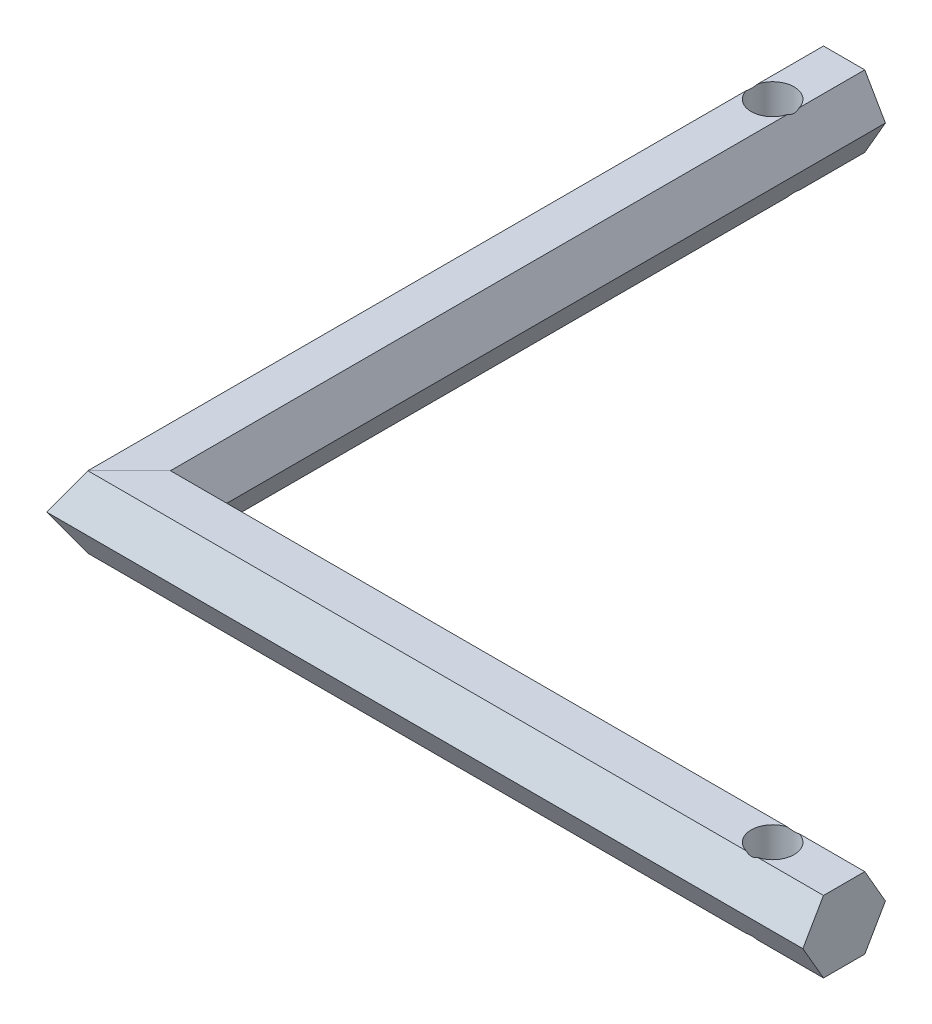
ISO-10303-21;
HEADER;
FILE_DESCRIPTION(('STEP AP214'),'2;1');
FILE_NAME('part.step','',(''),(''),'','','');
FILE_SCHEMA(('AUTOMOTIVE_DESIGN { 1 0 10303 214 1 1 1 1 }'));
ENDSEC;
DATA;
#1=APPLICATION_CONTEXT('core data for automotive mechanical design processes');
#2=APPLICATION_PROTOCOL_DEFINITION('international standard','automotive_design',2000,#1);
#3=PRODUCT_CONTEXT('',#1,'mechanical');
#4=PRODUCT('Part','Part','',(#3));
#5=PRODUCT_RELATED_PRODUCT_CATEGORY('part','',(#4));
#6=PRODUCT_DEFINITION_FORMATION('','',#4);
#7=PRODUCT_DEFINITION_CONTEXT('part definition',#1,'design');
#8=PRODUCT_DEFINITION('design','',#6,#7);
#9=PRODUCT_DEFINITION_SHAPE('','',#8);
#10=(LENGTH_UNIT() NAMED_UNIT(*) SI_UNIT(.MILLI.,.METRE.));
#11=(NAMED_UNIT(*) PLANE_ANGLE_UNIT() SI_UNIT($,.RADIAN.));
#12=(NAMED_UNIT(*) SI_UNIT($,.STERADIAN.) SOLID_ANGLE_UNIT());
#13=UNCERTAINTY_MEASURE_WITH_UNIT(LENGTH_MEASURE(1.E-05),#10,'distance_accuracy_value','');
#14=(GEOMETRIC_REPRESENTATION_CONTEXT(3) GLOBAL_UNCERTAINTY_ASSIGNED_CONTEXT((#13)) GLOBAL_UNIT_ASSIGNED_CONTEXT((#10,
#11,#12)) REPRESENTATION_CONTEXT('',''));
#15=CARTESIAN_POINT('',(0.,0.,0.));
#16=DIRECTION('',(0.,0.,1.));
#17=DIRECTION('',(1.,0.,0.));
#18=AXIS2_PLACEMENT_3D('',#15,#16,#17);
#19=CARTESIAN_POINT('',(-6.45085296108587,4.99999999999999,-2.88675134594811));
#20=DIRECTION('',(0.,1.,0.));
#21=DIRECTION('',(0.,0.,1.));
#22=AXIS2_PLACEMENT_3D('',#19,#20,#21);
#23=PLANE('',#22);
#24=CARTESIAN_POINT('',(90.,4.99999999999999,0.));
#25=DIRECTION('',(0.,1.,0.));
#26=DIRECTION('',(0.,0.,1.));
#27=AXIS2_PLACEMENT_3D('',#24,#25,#26);
#28=CIRCLE('',#27,3.00000000000001);
#29=CARTESIAN_POINT('',(90.8164965809278,4.99999999999999,2.88675134594813));
#30=VERTEX_POINT('',#29);
#31=CARTESIAN_POINT('',(90.8164965809278,4.99999999999999,-2.88675134594811));
#32=VERTEX_POINT('',#31);
#33=EDGE_CURVE('E360',#30,#32,#28,.T.);
#34=ORIENTED_EDGE('',*,*,#33,.F.);
#35=DIRECTION('',(1.,0.,0.));
#36=VECTOR('',#35,1.);
#37=CARTESIAN_POINT('',(-6.45085296108587,4.99999999999997,2.88675134594814));
#38=LINE('',#37,#36);
#39=CARTESIAN_POINT('',(100.,4.99999999999997,2.88675134594814));
#40=VERTEX_POINT('',#39);
#41=EDGE_CURVE('E266',#30,#40,#38,.T.);
#42=ORIENTED_EDGE('',*,*,#41,.T.);
#43=DIRECTION('',(0.,0.,1.));
#44=VECTOR('',#43,1.);
#45=CARTESIAN_POINT('',(100.,4.99999999999999,-2.88675134594811));
#46=LINE('',#45,#44);
#47=CARTESIAN_POINT('',(100.,4.99999999999999,-2.88675134594811));
#48=VERTEX_POINT('',#47);
#49=EDGE_CURVE('E246',#48,#40,#46,.T.);
#50=ORIENTED_EDGE('',*,*,#49,.F.);
#51=DIRECTION('',(1.,0.,0.));
#52=VECTOR('',#51,1.);
#53=CARTESIAN_POINT('',(-6.45085296108587,4.99999999999999,-2.88675134594811));
#54=LINE('',#53,#52);
#55=EDGE_CURVE('E271',#32,#48,#54,.T.);
#56=ORIENTED_EDGE('',*,*,#55,.F.);
#57=EDGE_LOOP('',(#34,#42,#50,#56));
#58=FACE_BOUND('',#57,.T.);
#59=ADVANCED_FACE('F39',(#58),#23,.T.);
#60=CARTESIAN_POINT('',(-6.45085296108587,-5.00000000000001,2.88675134594807));
#61=DIRECTION('',(0.,-1.,0.));
#62=DIRECTION('',(0.,0.,-1.));
#63=AXIS2_PLACEMENT_3D('',#60,#61,#62);
#64=PLANE('',#63);
#65=CARTESIAN_POINT('',(90.,-5.00000000000001,0.));
#66=DIRECTION('',(0.,1.,0.));
#67=DIRECTION('',(0.,0.,1.));
#68=AXIS2_PLACEMENT_3D('',#65,#66,#67);
#69=CIRCLE('',#68,3.00000000000001);
#70=CARTESIAN_POINT('',(90.816496580928,-5.00000000000001,2.88675134594807));
#71=VERTEX_POINT('',#70);
#72=CARTESIAN_POINT('',(90.8164965809276,-5.00000000000001,-2.88675134594818));
#73=VERTEX_POINT('',#72);
#74=EDGE_CURVE('E295',#71,#73,#69,.T.);
#75=ORIENTED_EDGE('',*,*,#74,.T.);
#76=DIRECTION('',(1.,0.,0.));
#77=VECTOR('',#76,1.);
#78=CARTESIAN_POINT('',(-6.45085296108587,-4.99999999999995,-2.88675134594818));
#79=LINE('',#78,#77);
#80=CARTESIAN_POINT('',(100.,-4.99999999999995,-2.88675134594818));
#81=VERTEX_POINT('',#80);
#82=EDGE_CURVE('E280',#73,#81,#79,.T.);
#83=ORIENTED_EDGE('',*,*,#82,.T.);
#84=DIRECTION('',(0.,0.,-1.));
#85=VECTOR('',#84,1.);
#86=CARTESIAN_POINT('',(100.,-5.00000000000001,2.88675134594807));
#87=LINE('',#86,#85);
#88=CARTESIAN_POINT('',(100.,-5.00000000000001,2.88675134594807));
#89=VERTEX_POINT('',#88);
#90=EDGE_CURVE('E234',#89,#81,#87,.T.);
#91=ORIENTED_EDGE('',*,*,#90,.F.);
#92=DIRECTION('',(1.,0.,0.));
#93=VECTOR('',#92,1.);
#94=CARTESIAN_POINT('',(-6.45085296108587,-5.00000000000001,2.88675134594807));
#95=LINE('',#94,#93);
#96=EDGE_CURVE('E257',#71,#89,#95,.T.);
#97=ORIENTED_EDGE('',*,*,#96,.F.);
#98=EDGE_LOOP('',(#75,#83,#91,#97));
#99=FACE_BOUND('',#98,.T.);
#100=ADVANCED_FACE('F293',(#99),#64,.T.);
#101=CARTESIAN_POINT('',(-2.88675134594807,-5.00000000000001,-100.));
#102=DIRECTION('',(0.,-1.,0.));
#103=DIRECTION('',(1.,0.,0.));
#104=AXIS2_PLACEMENT_3D('',#101,#102,#103);
#105=PLANE('',#104);
#106=CARTESIAN_POINT('',(0.,-5.00000000000001,-90.));
#107=DIRECTION('',(0.,1.,0.));
#108=DIRECTION('',(0.,0.,1.));
#109=AXIS2_PLACEMENT_3D('',#106,#107,#108);
#110=CIRCLE('',#109,3.);
#111=CARTESIAN_POINT('',(-2.88675134594807,-5.00000000000001,-89.1835034190721));
#112=VERTEX_POINT('',#111);
#113=CARTESIAN_POINT('',(2.88675134594814,-5.00000000000001,-89.1835034190723));
#114=VERTEX_POINT('',#113);
#115=EDGE_CURVE('E160',#112,#114,#110,.T.);
#116=ORIENTED_EDGE('',*,*,#115,.T.);
#117=DIRECTION('',(0.,0.,1.));
#118=VECTOR('',#117,1.);
#119=CARTESIAN_POINT('',(2.88675134594818,-4.99999999999995,-100.));
#120=LINE('',#119,#118);
#121=CARTESIAN_POINT('',(2.88675134594818,-4.99999999999995,-2.88675134594818));
#122=VERTEX_POINT('',#121);
#123=EDGE_CURVE('E174',#114,#122,#120,.T.);
#124=ORIENTED_EDGE('',*,*,#123,.T.);
#125=DIRECTION('',(-0.707106781186548,0.,0.707106781186548));
#126=VECTOR('',#125,1.);
#127=CARTESIAN_POINT('',(48.556624327026,-4.99999999999948,-48.556624327026));
#128=LINE('',#127,#126);
#129=CARTESIAN_POINT('',(-2.88675134594807,-5.00000000000001,2.88675134594808));
#130=VERTEX_POINT('',#129);
#131=EDGE_CURVE('E233',#122,#130,#128,.T.);
#132=ORIENTED_EDGE('',*,*,#131,.T.);
#133=DIRECTION('',(0.,0.,1.));
#134=VECTOR('',#133,1.);
#135=CARTESIAN_POINT('',(-2.88675134594807,-5.00000000000001,-100.));
#136=LINE('',#135,#134);
#137=EDGE_CURVE('E176',#112,#130,#136,.T.);
#138=ORIENTED_EDGE('',*,*,#137,.F.);
#139=EDGE_LOOP('',(#116,#124,#132,#138));
#140=FACE_BOUND('',#139,.T.);
#141=ADVANCED_FACE('F172',(#140),#105,.T.);
#142=CARTESIAN_POINT('',(2.88675134594811,4.99999999999999,-100.));
#143=DIRECTION('',(0.,1.,0.));
#144=DIRECTION('',(-1.,0.,0.));
#145=AXIS2_PLACEMENT_3D('',#142,#143,#144);
#146=PLANE('',#145);
#147=CARTESIAN_POINT('',(0.,4.99999999999999,-90.));
#148=DIRECTION('',(0.,1.,0.));
#149=DIRECTION('',(0.,0.,1.));
#150=AXIS2_PLACEMENT_3D('',#147,#148,#149);
#151=CIRCLE('',#150,3.);
#152=CARTESIAN_POINT('',(-2.88675134594814,4.99999999999999,-89.1835034190723));
#153=VERTEX_POINT('',#152);
#154=CARTESIAN_POINT('',(2.88675134594811,4.99999999999999,-89.1835034190722));
#155=VERTEX_POINT('',#154);
#156=EDGE_CURVE('E359',#153,#155,#151,.T.);
#157=ORIENTED_EDGE('',*,*,#156,.F.);
#158=DIRECTION('',(0.,0.,1.));
#159=VECTOR('',#158,1.);
#160=CARTESIAN_POINT('',(-2.88675134594814,4.99999999999997,-100.));
#161=LINE('',#160,#159);
#162=CARTESIAN_POINT('',(-2.88675134594814,4.99999999999997,2.88675134594813));
#163=VERTEX_POINT('',#162);
#164=EDGE_CURVE('E207',#153,#163,#161,.T.);
#165=ORIENTED_EDGE('',*,*,#164,.T.);
#166=DIRECTION('',(0.707106781186548,0.,-0.707106781186548));
#167=VECTOR('',#166,1.);
#168=CARTESIAN_POINT('',(51.4433756729741,5.00000000000017,-51.4433756729741));
#169=LINE('',#168,#167);
#170=CARTESIAN_POINT('',(2.88675134594811,4.99999999999999,-2.8867513459481));
#171=VERTEX_POINT('',#170);
#172=EDGE_CURVE('E316',#163,#171,#169,.T.);
#173=ORIENTED_EDGE('',*,*,#172,.T.);
#174=DIRECTION('',(0.,0.,1.));
#175=VECTOR('',#174,1.);
#176=CARTESIAN_POINT('',(2.88675134594811,4.99999999999999,-100.));
#177=LINE('',#176,#175);
#178=EDGE_CURVE('E208',#155,#171,#177,.T.);
#179=ORIENTED_EDGE('',*,*,#178,.F.);
#180=EDGE_LOOP('',(#157,#165,#173,#179));
#181=FACE_BOUND('',#180,.T.);
#182=ADVANCED_FACE('F377',(#181),#146,.T.);
#183=CARTESIAN_POINT('',(100.,0.,0.));
#184=DIRECTION('',(1.,0.,0.));
#185=DIRECTION('',(0.,0.,-1.));
#186=AXIS2_PLACEMENT_3D('',#183,#184,#185);
#187=PLANE('',#186);
#188=DIRECTION('',(0.,0.866025403784441,-0.499999999999995));
#189=VECTOR('',#188,1.);
#190=CARTESIAN_POINT('',(100.,-4.99999999999995,-2.88675134594818));
#191=LINE('',#190,#189);
#192=CARTESIAN_POINT('',(100.,0.,-5.77350269189624));
#193=VERTEX_POINT('',#192);
#194=EDGE_CURVE('E254',#81,#193,#191,.T.);
#195=ORIENTED_EDGE('',*,*,#194,.T.);
#196=DIRECTION('',(0.,0.866025403784438,0.500000000000001));
#197=VECTOR('',#196,1.);
#198=CARTESIAN_POINT('',(100.,0.,-5.77350269189624));
#199=LINE('',#198,#197);
#200=EDGE_CURVE('E250',#193,#48,#199,.T.);
#201=ORIENTED_EDGE('',*,*,#200,.T.);
#202=ORIENTED_EDGE('',*,*,#49,.T.);
#203=DIRECTION('',(0.,-0.866025403784442,0.499999999999995));
#204=VECTOR('',#203,1.);
#205=CARTESIAN_POINT('',(100.,4.99999999999997,2.88675134594814));
#206=LINE('',#205,#204);
#207=CARTESIAN_POINT('',(100.,0.,5.77350269189624));
#208=VERTEX_POINT('',#207);
#209=EDGE_CURVE('E243',#40,#208,#206,.T.);
#210=ORIENTED_EDGE('',*,*,#209,.T.);
#211=DIRECTION('',(0.,-0.866025403784434,-0.500000000000007));
#212=VECTOR('',#211,1.);
#213=CARTESIAN_POINT('',(100.,0.,5.77350269189624));
#214=LINE('',#213,#212);
#215=EDGE_CURVE('E238',#208,#89,#214,.T.);
#216=ORIENTED_EDGE('',*,*,#215,.T.);
#217=ORIENTED_EDGE('',*,*,#90,.T.);
#218=EDGE_LOOP('',(#195,#201,#202,#210,#216,#217));
#219=FACE_BOUND('',#218,.T.);
#220=ADVANCED_FACE('F41',(#219),#187,.T.);
#221=CARTESIAN_POINT('',(0.,0.,-100.));
#222=DIRECTION('',(0.,0.,1.));
#223=DIRECTION('',(1.,0.,0.));
#224=AXIS2_PLACEMENT_3D('',#221,#222,#223);
#225=PLANE('',#224);
#226=DIRECTION('',(0.499999999999995,0.866025403784441,0.));
#227=VECTOR('',#226,1.);
#228=CARTESIAN_POINT('',(2.88675134594818,-4.99999999999995,-100.));
#229=LINE('',#228,#227);
#230=CARTESIAN_POINT('',(2.88675134594818,-4.99999999999995,-100.));
#231=VERTEX_POINT('',#230);
#232=CARTESIAN_POINT('',(5.77350269189624,0.,-100.));
#233=VERTEX_POINT('',#232);
#234=EDGE_CURVE('E202',#231,#233,#229,.T.);
#235=ORIENTED_EDGE('',*,*,#234,.F.);
#236=DIRECTION('',(1.,0.,0.));
#237=VECTOR('',#236,1.);
#238=CARTESIAN_POINT('',(-2.88675134594807,-5.00000000000001,-100.));
#239=LINE('',#238,#237);
#240=CARTESIAN_POINT('',(-2.88675134594807,-5.00000000000001,-100.));
#241=VERTEX_POINT('',#240);
#242=EDGE_CURVE('E186',#241,#231,#239,.T.);
#243=ORIENTED_EDGE('',*,*,#242,.F.);
#244=DIRECTION('',(0.500000000000007,-0.866025403784434,0.));
#245=VECTOR('',#244,1.);
#246=CARTESIAN_POINT('',(-5.77350269189624,0.,-100.));
#247=LINE('',#246,#245);
#248=CARTESIAN_POINT('',(-5.77350269189624,0.,-100.));
#249=VERTEX_POINT('',#248);
#250=EDGE_CURVE('E192',#249,#241,#247,.T.);
#251=ORIENTED_EDGE('',*,*,#250,.F.);
#252=DIRECTION('',(-0.499999999999995,-0.866025403784442,0.));
#253=VECTOR('',#252,1.);
#254=CARTESIAN_POINT('',(-2.88675134594814,4.99999999999997,-100.));
#255=LINE('',#254,#253);
#256=CARTESIAN_POINT('',(-2.88675134594814,4.99999999999997,-100.));
#257=VERTEX_POINT('',#256);
#258=EDGE_CURVE('E212',#257,#249,#255,.T.);
#259=ORIENTED_EDGE('',*,*,#258,.F.);
#260=DIRECTION('',(-1.,0.,0.));
#261=VECTOR('',#260,1.);
#262=CARTESIAN_POINT('',(2.88675134594811,4.99999999999999,-100.));
#263=LINE('',#262,#261);
#264=CARTESIAN_POINT('',(2.88675134594811,4.99999999999999,-100.));
#265=VERTEX_POINT('',#264);
#266=EDGE_CURVE('E201',#265,#257,#263,.T.);
#267=ORIENTED_EDGE('',*,*,#266,.F.);
#268=DIRECTION('',(-0.500000000000001,0.866025403784438,0.));
#269=VECTOR('',#268,1.);
#270=CARTESIAN_POINT('',(5.77350269189624,0.,-100.));
#271=LINE('',#270,#269);
#272=EDGE_CURVE('E197',#233,#265,#271,.T.);
#273=ORIENTED_EDGE('',*,*,#272,.F.);
#274=EDGE_LOOP('',(#235,#243,#251,#259,#267,#273));
#275=FACE_BOUND('',#274,.T.);
#276=ADVANCED_FACE('F376',(#275),#225,.F.);
#277=CARTESIAN_POINT('',(-6.45085296108587,-4.99999999999995,-2.88675134594818));
#278=DIRECTION('',(0.,-0.499999999999995,-0.866025403784442));
#279=DIRECTION('',(0.,0.866025403784442,-0.499999999999995));
#280=AXIS2_PLACEMENT_3D('',#277,#278,#279);
#281=PLANE('',#280);
#282=CARTESIAN_POINT('',(90.,-10.0000000000001,0.));
#283=DIRECTION('',(0.,-0.499999999999995,-0.866025403784442));
#284=DIRECTION('',(0.,0.866025403784442,-0.499999999999995));
#285=AXIS2_PLACEMENT_3D('',#282,#283,#284);
#286=ELLIPSE('',#285,6.00000000000008,3.00000000000001);
#287=CARTESIAN_POINT('',(89.1835034190724,-5.00000000000001,-2.88675134594818));
#288=VERTEX_POINT('',#287);
#289=EDGE_CURVE('E239',#288,#73,#286,.T.);
#290=ORIENTED_EDGE('',*,*,#289,.F.);
#291=EDGE_CURVE('E281',#122,#288,#79,.T.);
#292=ORIENTED_EDGE('',*,*,#291,.F.);
#293=DIRECTION('',(-0.447213595499954,-0.774596669241488,0.447213595499954));
#294=VECTOR('',#293,1.);
#295=CARTESIAN_POINT('',(22.3094010767582,28.6410161513775,-22.3094010767582));
#296=LINE('',#295,#294);
#297=CARTESIAN_POINT('',(5.77350269189624,0.,-5.77350269189624));
#298=VERTEX_POINT('',#297);
#299=EDGE_CURVE('E183',#298,#122,#296,.T.);
#300=ORIENTED_EDGE('',*,*,#299,.F.);
#301=DIRECTION('',(1.,0.,0.));
#302=VECTOR('',#301,1.);
#303=CARTESIAN_POINT('',(-6.45085296108587,0.,-5.77350269189624));
#304=LINE('',#303,#302);
#305=EDGE_CURVE('E276',#298,#193,#304,.T.);
#306=ORIENTED_EDGE('',*,*,#305,.T.);
#307=ORIENTED_EDGE('',*,*,#194,.F.);
#308=ORIENTED_EDGE('',*,*,#82,.F.);
#309=EDGE_LOOP('',(#290,#292,#300,#306,#307,#308));
#310=FACE_BOUND('',#309,.T.);
#311=ADVANCED_FACE('F302',(#310),#281,.T.);
#312=CARTESIAN_POINT('',(-6.45085296108587,0.,-5.77350269189624));
#313=DIRECTION('',(0.,0.500000000000001,-0.866025403784438));
#314=DIRECTION('',(0.,0.866025403784438,0.500000000000001));
#315=AXIS2_PLACEMENT_3D('',#312,#313,#314);
#316=PLANE('',#315);
#317=CARTESIAN_POINT('',(90.,9.99999999999994,0.));
#318=DIRECTION('',(0.,0.500000000000001,-0.866025403784438));
#319=DIRECTION('',(0.,0.866025403784438,0.500000000000001));
#320=AXIS2_PLACEMENT_3D('',#317,#318,#319);
#321=ELLIPSE('',#320,6.,3.00000000000001);
#322=CARTESIAN_POINT('',(89.1835034190722,4.99999999999999,-2.88675134594811));
#323=VERTEX_POINT('',#322);
#324=EDGE_CURVE('E340',#32,#323,#321,.T.);
#325=ORIENTED_EDGE('',*,*,#324,.F.);
#326=ORIENTED_EDGE('',*,*,#55,.T.);
#327=ORIENTED_EDGE('',*,*,#200,.F.);
#328=ORIENTED_EDGE('',*,*,#305,.F.);
#329=DIRECTION('',(0.447213595499959,-0.774596669241483,-0.447213595499959));
#330=VECTOR('',#329,1.);
#331=CARTESIAN_POINT('',(24.6188021535171,-32.6410161513776,-24.6188021535171));
#332=LINE('',#331,#330);
#333=EDGE_CURVE('E169',#171,#298,#332,.T.);
#334=ORIENTED_EDGE('',*,*,#333,.F.);
#335=EDGE_CURVE('E272',#171,#323,#54,.T.);
#336=ORIENTED_EDGE('',*,*,#335,.T.);
#337=EDGE_LOOP('',(#325,#326,#327,#328,#334,#336));
#338=FACE_BOUND('',#337,.T.);
#339=ADVANCED_FACE('F308',(#338),#316,.T.);
#340=CARTESIAN_POINT('',(89.1835034190723,4.99999999999997,2.88675134594814));
#341=VERTEX_POINT('',#340);
#342=EDGE_CURVE('E55',#323,#341,#28,.T.);
#343=ORIENTED_EDGE('',*,*,#342,.F.);
#344=ORIENTED_EDGE('',*,*,#335,.F.);
#345=ORIENTED_EDGE('',*,*,#172,.F.);
#346=EDGE_CURVE('E267',#163,#341,#38,.T.);
#347=ORIENTED_EDGE('',*,*,#346,.T.);
#348=EDGE_LOOP('',(#343,#344,#345,#347));
#349=FACE_BOUND('',#348,.T.);
#350=ADVANCED_FACE('F380',(#349),#23,.T.);
#351=CARTESIAN_POINT('',(-6.45085296108587,4.99999999999997,2.88675134594814));
#352=DIRECTION('',(0.,0.499999999999995,0.866025403784441));
#353=DIRECTION('',(0.,-0.866025403784441,0.499999999999995));
#354=AXIS2_PLACEMENT_3D('',#351,#352,#353);
#355=PLANE('',#354);
#356=CARTESIAN_POINT('',(90.,10.0000000000001,0.));
#357=DIRECTION('',(0.,0.499999999999995,0.866025403784441));
#358=DIRECTION('',(0.,0.866025403784441,-0.499999999999995));
#359=AXIS2_PLACEMENT_3D('',#356,#357,#358);
#360=ELLIPSE('',#359,6.00000000000007,3.00000000000001);
#361=EDGE_CURVE('E343',#341,#30,#360,.T.);
#362=ORIENTED_EDGE('',*,*,#361,.F.);
#363=ORIENTED_EDGE('',*,*,#346,.F.);
#364=DIRECTION('',(0.447213595499954,0.774596669241488,-0.447213595499954));
#365=VECTOR('',#364,1.);
#366=CARTESIAN_POINT('',(17.6905989232412,40.6410161513774,-17.6905989232412));
#367=LINE('',#366,#365);
#368=CARTESIAN_POINT('',(-5.77350269189624,0.,5.77350269189623));
#369=VERTEX_POINT('',#368);
#370=EDGE_CURVE('E328',#369,#163,#367,.T.);
#371=ORIENTED_EDGE('',*,*,#370,.F.);
#372=DIRECTION('',(1.,0.,0.));
#373=VECTOR('',#372,1.);
#374=CARTESIAN_POINT('',(-6.45085296108587,0.,5.77350269189624));
#375=LINE('',#374,#373);
#376=EDGE_CURVE('E262',#369,#208,#375,.T.);
#377=ORIENTED_EDGE('',*,*,#376,.T.);
#378=ORIENTED_EDGE('',*,*,#209,.F.);
#379=ORIENTED_EDGE('',*,*,#41,.F.);
#380=EDGE_LOOP('',(#362,#363,#371,#377,#378,#379));
#381=FACE_BOUND('',#380,.T.);
#382=ADVANCED_FACE('F382',(#381),#355,.T.);
#383=CARTESIAN_POINT('',(-6.45085296108587,0.,5.77350269189624));
#384=DIRECTION('',(0.,-0.500000000000007,0.866025403784435));
#385=DIRECTION('',(0.,-0.866025403784435,-0.500000000000007));
#386=AXIS2_PLACEMENT_3D('',#383,#384,#385);
#387=PLANE('',#386);
#388=CARTESIAN_POINT('',(90.,-9.99999999999982,0.));
#389=DIRECTION('',(0.,-0.500000000000007,0.866025403784435));
#390=DIRECTION('',(0.,0.866025403784435,0.500000000000007));
#391=AXIS2_PLACEMENT_3D('',#388,#389,#390);
#392=ELLIPSE('',#391,5.99999999999993,3.00000000000001);
#393=CARTESIAN_POINT('',(89.1835034190721,-5.00000000000001,2.88675134594807));
#394=VERTEX_POINT('',#393);
#395=EDGE_CURVE('E62',#71,#394,#392,.T.);
#396=ORIENTED_EDGE('',*,*,#395,.F.);
#397=ORIENTED_EDGE('',*,*,#96,.T.);
#398=ORIENTED_EDGE('',*,*,#215,.F.);
#399=ORIENTED_EDGE('',*,*,#376,.F.);
#400=DIRECTION('',(-0.447213595499963,0.774596669241478,0.447213595499963));
#401=VECTOR('',#400,1.);
#402=CARTESIAN_POINT('',(15.3811978464835,-36.6410161513777,-15.3811978464835));
#403=LINE('',#402,#401);
#404=EDGE_CURVE('E324',#130,#369,#403,.T.);
#405=ORIENTED_EDGE('',*,*,#404,.F.);
#406=EDGE_CURVE('E258',#130,#394,#95,.T.);
#407=ORIENTED_EDGE('',*,*,#406,.T.);
#408=EDGE_LOOP('',(#396,#397,#398,#399,#405,#407));
#409=FACE_BOUND('',#408,.T.);
#410=ADVANCED_FACE('F392',(#409),#387,.T.);
#411=CARTESIAN_POINT('',(90.,-4.99999999999998,0.));
#412=DIRECTION('',(0.,-1.,0.));
#413=DIRECTION('',(0.,0.,-1.));
#414=AXIS2_PLACEMENT_3D('',#411,#412,#413);
#415=CIRCLE('',#414,3.00000000000001);
#416=EDGE_CURVE('E11',#394,#288,#415,.T.);
#417=ORIENTED_EDGE('',*,*,#416,.F.);
#418=ORIENTED_EDGE('',*,*,#406,.F.);
#419=ORIENTED_EDGE('',*,*,#131,.F.);
#420=ORIENTED_EDGE('',*,*,#291,.T.);
#421=EDGE_LOOP('',(#417,#418,#419,#420));
#422=FACE_BOUND('',#421,.T.);
#423=ADVANCED_FACE('F393',(#422),#64,.T.);
#424=CARTESIAN_POINT('',(2.88675134594818,-4.99999999999995,-90.8164965809277));
#425=VERTEX_POINT('',#424);
#426=CARTESIAN_POINT('',(-2.88675134594807,-5.00000000000001,-90.8164965809279));
#427=VERTEX_POINT('',#426);
#428=EDGE_CURVE('E163',#425,#427,#110,.T.);
#429=ORIENTED_EDGE('',*,*,#428,.T.);
#430=EDGE_CURVE('E227',#241,#427,#136,.T.);
#431=ORIENTED_EDGE('',*,*,#430,.F.);
#432=ORIENTED_EDGE('',*,*,#242,.T.);
#433=EDGE_CURVE('E185',#231,#425,#120,.T.);
#434=ORIENTED_EDGE('',*,*,#433,.T.);
#435=EDGE_LOOP('',(#429,#431,#432,#434));
#436=FACE_BOUND('',#435,.T.);
#437=ADVANCED_FACE('F398',(#436),#105,.T.);
#438=CARTESIAN_POINT('',(-5.77350269189624,0.,-100.));
#439=DIRECTION('',(-0.866025403784434,-0.500000000000007,0.));
#440=DIRECTION('',(0.500000000000007,-0.866025403784435,0.));
#441=AXIS2_PLACEMENT_3D('',#438,#439,#440);
#442=PLANE('',#441);
#443=CARTESIAN_POINT('',(0.,-9.99999999999982,-90.));
#444=DIRECTION('',(-0.866025403784434,-0.500000000000007,0.));
#445=DIRECTION('',(-0.500000000000007,0.866025403784435,0.));
#446=AXIS2_PLACEMENT_3D('',#443,#444,#445);
#447=ELLIPSE('',#446,5.99999999999992,3.);
#448=EDGE_CURVE('E348',#112,#427,#447,.T.);
#449=ORIENTED_EDGE('',*,*,#448,.F.);
#450=ORIENTED_EDGE('',*,*,#137,.T.);
#451=ORIENTED_EDGE('',*,*,#404,.T.);
#452=DIRECTION('',(0.,0.,1.));
#453=VECTOR('',#452,1.);
#454=CARTESIAN_POINT('',(-5.77350269189624,0.,-100.));
#455=LINE('',#454,#453);
#456=EDGE_CURVE('E217',#249,#369,#455,.T.);
#457=ORIENTED_EDGE('',*,*,#456,.F.);
#458=ORIENTED_EDGE('',*,*,#250,.T.);
#459=ORIENTED_EDGE('',*,*,#430,.T.);
#460=EDGE_LOOP('',(#449,#450,#451,#457,#458,#459));
#461=FACE_BOUND('',#460,.T.);
#462=ADVANCED_FACE('F387',(#461),#442,.T.);
#463=CARTESIAN_POINT('',(-2.88675134594814,4.99999999999997,-100.));
#464=DIRECTION('',(-0.866025403784441,0.499999999999995,0.));
#465=DIRECTION('',(-0.499999999999995,-0.866025403784442,0.));
#466=AXIS2_PLACEMENT_3D('',#463,#464,#465);
#467=PLANE('',#466);
#468=CARTESIAN_POINT('',(0.,10.0000000000001,-90.));
#469=DIRECTION('',(-0.866025403784441,0.499999999999995,0.));
#470=DIRECTION('',(0.499999999999995,0.866025403784442,0.));
#471=AXIS2_PLACEMENT_3D('',#468,#469,#470);
#472=ELLIPSE('',#471,6.00000000000006,3.);
#473=CARTESIAN_POINT('',(-2.88675134594814,4.99999999999999,-90.8164965809277));
#474=VERTEX_POINT('',#473);
#475=EDGE_CURVE('E351',#474,#153,#472,.T.);
#476=ORIENTED_EDGE('',*,*,#475,.F.);
#477=EDGE_CURVE('E213',#257,#474,#161,.T.);
#478=ORIENTED_EDGE('',*,*,#477,.F.);
#479=ORIENTED_EDGE('',*,*,#258,.T.);
#480=ORIENTED_EDGE('',*,*,#456,.T.);
#481=ORIENTED_EDGE('',*,*,#370,.T.);
#482=ORIENTED_EDGE('',*,*,#164,.F.);
#483=EDGE_LOOP('',(#476,#478,#479,#480,#481,#482));
#484=FACE_BOUND('',#483,.T.);
#485=ADVANCED_FACE('F373',(#484),#467,.T.);
#486=CARTESIAN_POINT('',(2.88675134594811,4.99999999999999,-90.8164965809278));
#487=VERTEX_POINT('',#486);
#488=EDGE_CURVE('E178',#487,#474,#151,.T.);
#489=ORIENTED_EDGE('',*,*,#488,.F.);
#490=EDGE_CURVE('E203',#265,#487,#177,.T.);
#491=ORIENTED_EDGE('',*,*,#490,.F.);
#492=ORIENTED_EDGE('',*,*,#266,.T.);
#493=ORIENTED_EDGE('',*,*,#477,.T.);
#494=EDGE_LOOP('',(#489,#491,#492,#493));
#495=FACE_BOUND('',#494,.T.);
#496=ADVANCED_FACE('F374',(#495),#146,.T.);
#497=CARTESIAN_POINT('',(5.77350269189624,0.,-100.));
#498=DIRECTION('',(0.866025403784438,0.500000000000001,0.));
#499=DIRECTION('',(-0.500000000000001,0.866025403784438,0.));
#500=AXIS2_PLACEMENT_3D('',#497,#498,#499);
#501=PLANE('',#500);
#502=CARTESIAN_POINT('',(0.,9.99999999999994,-90.));
#503=DIRECTION('',(0.866025403784438,0.500000000000001,0.));
#504=DIRECTION('',(-0.500000000000001,0.866025403784438,0.));
#505=AXIS2_PLACEMENT_3D('',#502,#503,#504);
#506=ELLIPSE('',#505,5.99999999999999,3.);
#507=EDGE_CURVE('E354',#155,#487,#506,.T.);
#508=ORIENTED_EDGE('',*,*,#507,.F.);
#509=ORIENTED_EDGE('',*,*,#178,.T.);
#510=ORIENTED_EDGE('',*,*,#333,.T.);
#511=DIRECTION('',(0.,0.,1.));
#512=VECTOR('',#511,1.);
#513=CARTESIAN_POINT('',(5.77350269189624,0.,-100.));
#514=LINE('',#513,#512);
#515=EDGE_CURVE('E190',#233,#298,#514,.T.);
#516=ORIENTED_EDGE('',*,*,#515,.F.);
#517=ORIENTED_EDGE('',*,*,#272,.T.);
#518=ORIENTED_EDGE('',*,*,#490,.T.);
#519=EDGE_LOOP('',(#508,#509,#510,#516,#517,#518));
#520=FACE_BOUND('',#519,.T.);
#521=ADVANCED_FACE('F313',(#520),#501,.T.);
#522=CARTESIAN_POINT('',(2.88675134594818,-4.99999999999995,-100.));
#523=DIRECTION('',(0.866025403784442,-0.499999999999995,0.));
#524=DIRECTION('',(0.499999999999995,0.866025403784442,0.));
#525=AXIS2_PLACEMENT_3D('',#522,#523,#524);
#526=PLANE('',#525);
#527=CARTESIAN_POINT('',(0.,-10.0000000000001,-90.));
#528=DIRECTION('',(0.866025403784442,-0.499999999999995,0.));
#529=DIRECTION('',(0.499999999999995,0.866025403784442,0.));
#530=AXIS2_PLACEMENT_3D('',#527,#528,#529);
#531=ELLIPSE('',#530,6.00000000000006,3.);
#532=EDGE_CURVE('E48',#425,#114,#531,.T.);
#533=ORIENTED_EDGE('',*,*,#532,.F.);
#534=ORIENTED_EDGE('',*,*,#433,.F.);
#535=ORIENTED_EDGE('',*,*,#234,.T.);
#536=ORIENTED_EDGE('',*,*,#515,.T.);
#537=ORIENTED_EDGE('',*,*,#299,.T.);
#538=ORIENTED_EDGE('',*,*,#123,.F.);
#539=EDGE_LOOP('',(#533,#534,#535,#536,#537,#538));
#540=FACE_BOUND('',#539,.T.);
#541=ADVANCED_FACE('F181',(#540),#526,.T.);
#542=CARTESIAN_POINT('',(0.,-5.00000000000001,-90.));
#543=DIRECTION('',(0.,1.,0.));
#544=DIRECTION('',(0.,0.,1.));
#545=AXIS2_PLACEMENT_3D('',#542,#543,#544);
#546=CYLINDRICAL_SURFACE('',#545,3.);
#547=ORIENTED_EDGE('',*,*,#448,.T.);
#548=ORIENTED_EDGE('',*,*,#428,.F.);
#549=ORIENTED_EDGE('',*,*,#532,.T.);
#550=ORIENTED_EDGE('',*,*,#115,.F.);
#551=EDGE_LOOP('',(#547,#548,#549,#550));
#552=FACE_BOUND('',#551,.T.);
#553=ORIENTED_EDGE('',*,*,#475,.T.);
#554=ORIENTED_EDGE('',*,*,#156,.T.);
#555=ORIENTED_EDGE('',*,*,#507,.T.);
#556=ORIENTED_EDGE('',*,*,#488,.T.);
#557=EDGE_LOOP('',(#553,#554,#555,#556));
#558=FACE_BOUND('',#557,.T.);
#559=ADVANCED_FACE('F158',(#552,#558),#546,.F.);
#560=CARTESIAN_POINT('',(90.,-5.00000000000001,0.));
#561=DIRECTION('',(0.,1.,0.));
#562=DIRECTION('',(0.,0.,1.));
#563=AXIS2_PLACEMENT_3D('',#560,#561,#562);
#564=CYLINDRICAL_SURFACE('',#563,3.00000000000001);
#565=ORIENTED_EDGE('',*,*,#289,.T.);
#566=ORIENTED_EDGE('',*,*,#74,.F.);
#567=ORIENTED_EDGE('',*,*,#395,.T.);
#568=ORIENTED_EDGE('',*,*,#416,.T.);
#569=EDGE_LOOP('',(#565,#566,#567,#568));
#570=FACE_BOUND('',#569,.T.);
#571=ORIENTED_EDGE('',*,*,#324,.T.);
#572=ORIENTED_EDGE('',*,*,#342,.T.);
#573=ORIENTED_EDGE('',*,*,#361,.T.);
#574=ORIENTED_EDGE('',*,*,#33,.T.);
#575=EDGE_LOOP('',(#571,#572,#573,#574));
#576=FACE_BOUND('',#575,.T.);
#577=ADVANCED_FACE('F394',(#570,#576),#564,.F.);
#578=CLOSED_SHELL('',(#59,#100,#141,#182,#220,#276,#311,#339,#350,#382,#410,#423,#437,#462,#485,
#496,#521,#541,#559,#577));
#579=MANIFOLD_SOLID_BREP('B2',#578);
#580=ADVANCED_BREP_SHAPE_REPRESENTATION('',(#18,#579),#14);
#581=SHAPE_DEFINITION_REPRESENTATION(#9,#580);
ENDSEC;
END-ISO-10303-21;
